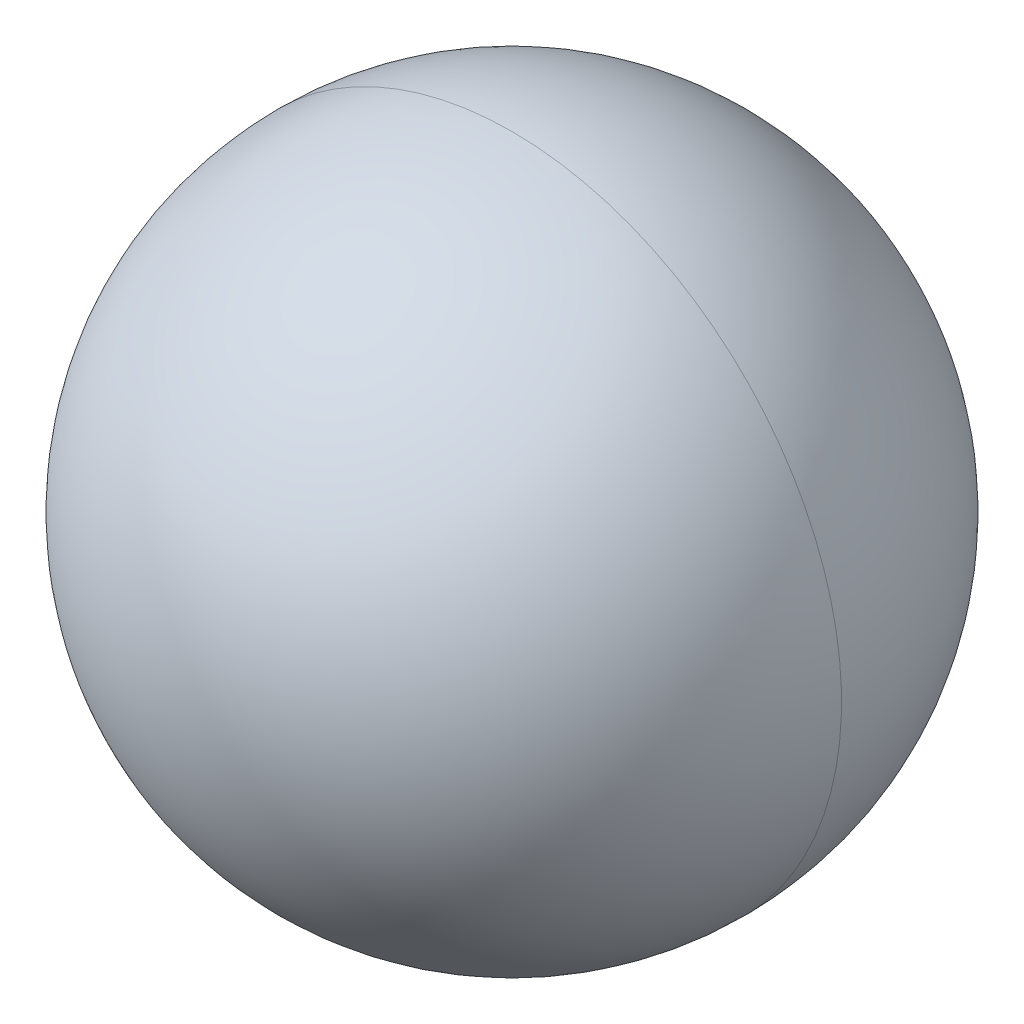
ISO-10303-21;
HEADER;
FILE_DESCRIPTION(('STEP AP214'),'2;1');
FILE_NAME('part.step','',(''),(''),'','','');
FILE_SCHEMA(('AUTOMOTIVE_DESIGN { 1 0 10303 214 1 1 1 1 }'));
ENDSEC;
DATA;
#1=APPLICATION_CONTEXT('core data for automotive mechanical design processes');
#2=APPLICATION_PROTOCOL_DEFINITION('international standard','automotive_design',2000,#1);
#3=PRODUCT_CONTEXT('',#1,'mechanical');
#4=PRODUCT('Part','Part','',(#3));
#5=PRODUCT_RELATED_PRODUCT_CATEGORY('part','',(#4));
#6=PRODUCT_DEFINITION_FORMATION('','',#4);
#7=PRODUCT_DEFINITION_CONTEXT('part definition',#1,'design');
#8=PRODUCT_DEFINITION('design','',#6,#7);
#9=PRODUCT_DEFINITION_SHAPE('','',#8);
#10=(LENGTH_UNIT() NAMED_UNIT(*) SI_UNIT(.MILLI.,.METRE.));
#11=(NAMED_UNIT(*) PLANE_ANGLE_UNIT() SI_UNIT($,.RADIAN.));
#12=(NAMED_UNIT(*) SI_UNIT($,.STERADIAN.) SOLID_ANGLE_UNIT());
#13=UNCERTAINTY_MEASURE_WITH_UNIT(LENGTH_MEASURE(1.E-05),#10,'distance_accuracy_value','');
#14=(GEOMETRIC_REPRESENTATION_CONTEXT(3) GLOBAL_UNCERTAINTY_ASSIGNED_CONTEXT((#13)) GLOBAL_UNIT_ASSIGNED_CONTEXT((#10,
#11,#12)) REPRESENTATION_CONTEXT('',''));
#15=CARTESIAN_POINT('',(0.,0.,0.));
#16=DIRECTION('',(0.,0.,1.));
#17=DIRECTION('',(1.,0.,0.));
#18=AXIS2_PLACEMENT_3D('',#15,#16,#17);
#19=CARTESIAN_POINT('',(0.,0.,0.));
#20=DIRECTION('',(0.,0.,1.));
#21=DIRECTION('',(-1.,0.,0.));
#22=AXIS2_PLACEMENT_3D('',#19,#20,#21);
#23=SPHERICAL_SURFACE('',#22,7.);
#24=CARTESIAN_POINT('',(0.,0.,0.));
#25=DIRECTION('',(0.,0.,1.));
#26=DIRECTION('',(1.,0.,0.));
#27=AXIS2_PLACEMENT_3D('',#24,#25,#26);
#28=CIRCLE('',#27,7.);
#29=CARTESIAN_POINT('',(0.,-7.,0.));
#30=VERTEX_POINT('',#29);
#31=CARTESIAN_POINT('',(0.,7.,0.));
#32=VERTEX_POINT('',#31);
#33=EDGE_CURVE('E11',#30,#32,#28,.T.);
#34=ORIENTED_EDGE('',*,*,#33,.F.);
#35=CARTESIAN_POINT('',(0.,0.,0.));
#36=DIRECTION('',(0.,0.,-1.));
#37=DIRECTION('',(-1.,0.,0.));
#38=AXIS2_PLACEMENT_3D('',#35,#36,#37);
#39=CIRCLE('',#38,7.);
#40=EDGE_CURVE('E20',#30,#32,#39,.T.);
#41=ORIENTED_EDGE('',*,*,#40,.T.);
#42=EDGE_LOOP('',(#34,#41));
#43=FACE_BOUND('',#42,.T.);
#44=ADVANCED_FACE('F16',(#43),#23,.T.);
#45=CARTESIAN_POINT('',(0.,0.,0.));
#46=DIRECTION('',(0.,0.,1.));
#47=DIRECTION('',(-1.,0.,0.));
#48=AXIS2_PLACEMENT_3D('',#45,#46,#47);
#49=SPHERICAL_SURFACE('',#48,7.);
#50=ORIENTED_EDGE('',*,*,#40,.F.);
#51=ORIENTED_EDGE('',*,*,#33,.T.);
#52=EDGE_LOOP('',(#50,#51));
#53=FACE_BOUND('',#52,.T.);
#54=ADVANCED_FACE('F18',(#53),#49,.T.);
#55=CLOSED_SHELL('',(#44,#54));
#56=MANIFOLD_SOLID_BREP('B1',#55);
#57=ADVANCED_BREP_SHAPE_REPRESENTATION('',(#18,#56),#14);
#58=SHAPE_DEFINITION_REPRESENTATION(#9,#57);
ENDSEC;
END-ISO-10303-21;
